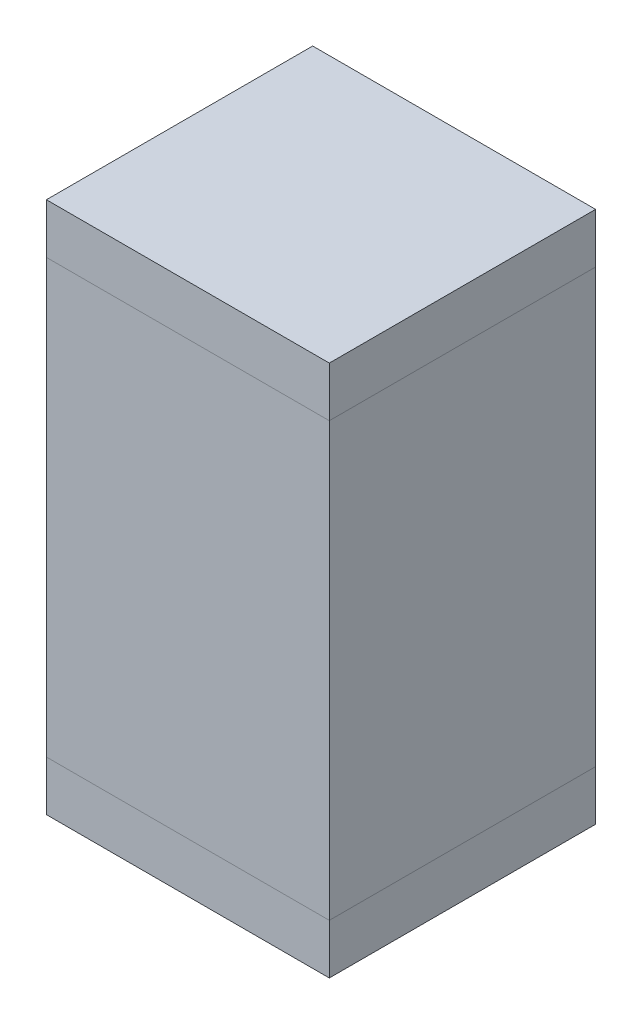
ISO-10303-21;
HEADER;
FILE_DESCRIPTION(('STEP AP214'),'2;1');
FILE_NAME('part.step','',(''),(''),'','','');
FILE_SCHEMA(('AUTOMOTIVE_DESIGN { 1 0 10303 214 1 1 1 1 }'));
ENDSEC;
DATA;
#1=APPLICATION_CONTEXT('core data for automotive mechanical design processes');
#2=APPLICATION_PROTOCOL_DEFINITION('international standard','automotive_design',2000,#1);
#3=PRODUCT_CONTEXT('',#1,'mechanical');
#4=PRODUCT('Part','Part','',(#3));
#5=PRODUCT_RELATED_PRODUCT_CATEGORY('part','',(#4));
#6=PRODUCT_DEFINITION_FORMATION('','',#4);
#7=PRODUCT_DEFINITION_CONTEXT('part definition',#1,'design');
#8=PRODUCT_DEFINITION('design','',#6,#7);
#9=PRODUCT_DEFINITION_SHAPE('','',#8);
#10=(LENGTH_UNIT() NAMED_UNIT(*) SI_UNIT(.MILLI.,.METRE.));
#11=(NAMED_UNIT(*) PLANE_ANGLE_UNIT() SI_UNIT($,.RADIAN.));
#12=(NAMED_UNIT(*) SI_UNIT($,.STERADIAN.) SOLID_ANGLE_UNIT());
#13=UNCERTAINTY_MEASURE_WITH_UNIT(LENGTH_MEASURE(1.E-05),#10,'distance_accuracy_value','');
#14=(GEOMETRIC_REPRESENTATION_CONTEXT(3) GLOBAL_UNCERTAINTY_ASSIGNED_CONTEXT((#13)) GLOBAL_UNIT_ASSIGNED_CONTEXT((#10,
#11,#12)) REPRESENTATION_CONTEXT('',''));
#15=CARTESIAN_POINT('',(0.,0.,0.));
#16=DIRECTION('',(0.,0.,1.));
#17=DIRECTION('',(1.,0.,0.));
#18=AXIS2_PLACEMENT_3D('',#15,#16,#17);
#19=CARTESIAN_POINT('',(0.,0.,0.));
#20=DIRECTION('',(0.,0.,1.));
#21=DIRECTION('',(1.,0.,0.));
#22=AXIS2_PLACEMENT_3D('',#19,#20,#21);
#23=PLANE('',#22);
#24=DIRECTION('',(1.,0.,0.));
#25=VECTOR('',#24,1.);
#26=CARTESIAN_POINT('',(-0.425,0.65,0.));
#27=LINE('',#26,#25);
#28=CARTESIAN_POINT('',(-0.425,0.65,0.));
#29=VERTEX_POINT('',#28);
#30=CARTESIAN_POINT('',(0.425,0.65,0.));
#31=VERTEX_POINT('',#30);
#32=EDGE_CURVE('P0_E20',#29,#31,#27,.T.);
#33=ORIENTED_EDGE('',*,*,#32,.T.);
#34=DIRECTION('',(0.,-1.,0.));
#35=VECTOR('',#34,1.);
#36=CARTESIAN_POINT('',(0.425,0.65,0.));
#37=LINE('',#36,#35);
#38=CARTESIAN_POINT('',(0.425,-0.65,0.));
#39=VERTEX_POINT('',#38);
#40=EDGE_CURVE('P0_E100',#31,#39,#37,.T.);
#41=ORIENTED_EDGE('',*,*,#40,.T.);
#42=DIRECTION('',(-1.,0.,0.));
#43=VECTOR('',#42,1.);
#44=CARTESIAN_POINT('',(0.425,-0.65,0.));
#45=LINE('',#44,#43);
#46=CARTESIAN_POINT('',(-0.425,-0.65,0.));
#47=VERTEX_POINT('',#46);
#48=EDGE_CURVE('P0_E86',#39,#47,#45,.T.);
#49=ORIENTED_EDGE('',*,*,#48,.T.);
#50=DIRECTION('',(0.,1.,0.));
#51=VECTOR('',#50,1.);
#52=CARTESIAN_POINT('',(-0.425,-0.65,0.));
#53=LINE('',#52,#51);
#54=EDGE_CURVE('P0_E71',#47,#29,#53,.T.);
#55=ORIENTED_EDGE('',*,*,#54,.T.);
#56=EDGE_LOOP('',(#33,#41,#49,#55));
#57=FACE_BOUND('',#56,.T.);
#58=ADVANCED_FACE('P0_F17',(#57),#23,.F.);
#59=CARTESIAN_POINT('',(0.,0.,0.8));
#60=DIRECTION('',(0.,0.,1.));
#61=DIRECTION('',(1.,0.,0.));
#62=AXIS2_PLACEMENT_3D('',#59,#60,#61);
#63=PLANE('',#62);
#64=DIRECTION('',(-1.,0.,0.));
#65=VECTOR('',#64,1.);
#66=CARTESIAN_POINT('',(-0.425,0.65,0.8));
#67=LINE('',#66,#65);
#68=CARTESIAN_POINT('',(0.425,0.65,0.8));
#69=VERTEX_POINT('',#68);
#70=CARTESIAN_POINT('',(-0.425,0.65,0.8));
#71=VERTEX_POINT('',#70);
#72=EDGE_CURVE('P0_E11',#69,#71,#67,.T.);
#73=ORIENTED_EDGE('',*,*,#72,.T.);
#74=DIRECTION('',(0.,-1.,0.));
#75=VECTOR('',#74,1.);
#76=CARTESIAN_POINT('',(-0.425,-0.65,0.8));
#77=LINE('',#76,#75);
#78=CARTESIAN_POINT('',(-0.425,-0.65,0.8));
#79=VERTEX_POINT('',#78);
#80=EDGE_CURVE('P0_E61',#71,#79,#77,.T.);
#81=ORIENTED_EDGE('',*,*,#80,.T.);
#82=DIRECTION('',(1.,0.,0.));
#83=VECTOR('',#82,1.);
#84=CARTESIAN_POINT('',(0.425,-0.65,0.8));
#85=LINE('',#84,#83);
#86=CARTESIAN_POINT('',(0.425,-0.65,0.8));
#87=VERTEX_POINT('',#86);
#88=EDGE_CURVE('P0_E65',#79,#87,#85,.T.);
#89=ORIENTED_EDGE('',*,*,#88,.T.);
#90=DIRECTION('',(0.,1.,0.));
#91=VECTOR('',#90,1.);
#92=CARTESIAN_POINT('',(0.425,0.65,0.8));
#93=LINE('',#92,#91);
#94=EDGE_CURVE('P0_E104',#87,#69,#93,.T.);
#95=ORIENTED_EDGE('',*,*,#94,.T.);
#96=EDGE_LOOP('',(#73,#81,#89,#95));
#97=FACE_BOUND('',#96,.T.);
#98=ADVANCED_FACE('P0_F63',(#97),#63,.T.);
#99=CARTESIAN_POINT('',(0.425,0.65,0.));
#100=DIRECTION('',(0.,1.,0.));
#101=DIRECTION('',(1.,0.,0.));
#102=AXIS2_PLACEMENT_3D('',#99,#100,#101);
#103=PLANE('',#102);
#104=ORIENTED_EDGE('',*,*,#32,.F.);
#105=DIRECTION('',(0.,0.,1.));
#106=VECTOR('',#105,1.);
#107=CARTESIAN_POINT('',(-0.425,0.65,0.));
#108=LINE('',#107,#106);
#109=EDGE_CURVE('P0_E70',#29,#71,#108,.T.);
#110=ORIENTED_EDGE('',*,*,#109,.T.);
#111=ORIENTED_EDGE('',*,*,#72,.F.);
#112=DIRECTION('',(0.,0.,1.));
#113=VECTOR('',#112,1.);
#114=CARTESIAN_POINT('',(0.425,0.65,0.));
#115=LINE('',#114,#113);
#116=EDGE_CURVE('P0_E109',#31,#69,#115,.T.);
#117=ORIENTED_EDGE('',*,*,#116,.F.);
#118=EDGE_LOOP('',(#104,#110,#111,#117));
#119=FACE_BOUND('',#118,.T.);
#120=ADVANCED_FACE('P0_F124',(#119),#103,.T.);
#121=CARTESIAN_POINT('',(-0.425,0.65,0.));
#122=DIRECTION('',(-1.,0.,0.));
#123=DIRECTION('',(0.,0.,1.));
#124=AXIS2_PLACEMENT_3D('',#121,#122,#123);
#125=PLANE('',#124);
#126=ORIENTED_EDGE('',*,*,#54,.F.);
#127=DIRECTION('',(0.,0.,1.));
#128=VECTOR('',#127,1.);
#129=CARTESIAN_POINT('',(-0.425,-0.65,0.));
#130=LINE('',#129,#128);
#131=EDGE_CURVE('P0_E74',#47,#79,#130,.T.);
#132=ORIENTED_EDGE('',*,*,#131,.T.);
#133=ORIENTED_EDGE('',*,*,#80,.F.);
#134=ORIENTED_EDGE('',*,*,#109,.F.);
#135=EDGE_LOOP('',(#126,#132,#133,#134));
#136=FACE_BOUND('',#135,.T.);
#137=ADVANCED_FACE('P0_F75',(#136),#125,.T.);
#138=CARTESIAN_POINT('',(-0.425,-0.65,0.));
#139=DIRECTION('',(0.,-1.,0.));
#140=DIRECTION('',(0.,0.,-1.));
#141=AXIS2_PLACEMENT_3D('',#138,#139,#140);
#142=PLANE('',#141);
#143=ORIENTED_EDGE('',*,*,#48,.F.);
#144=DIRECTION('',(0.,0.,1.));
#145=VECTOR('',#144,1.);
#146=CARTESIAN_POINT('',(0.425,-0.65,0.));
#147=LINE('',#146,#145);
#148=EDGE_CURVE('P0_E83',#39,#87,#147,.T.);
#149=ORIENTED_EDGE('',*,*,#148,.T.);
#150=ORIENTED_EDGE('',*,*,#88,.F.);
#151=ORIENTED_EDGE('',*,*,#131,.F.);
#152=EDGE_LOOP('',(#143,#149,#150,#151));
#153=FACE_BOUND('',#152,.T.);
#154=ADVANCED_FACE('P0_F81',(#153),#142,.T.);
#155=CARTESIAN_POINT('',(0.425,-0.65,0.));
#156=DIRECTION('',(1.,0.,0.));
#157=DIRECTION('',(0.,1.,0.));
#158=AXIS2_PLACEMENT_3D('',#155,#156,#157);
#159=PLANE('',#158);
#160=ORIENTED_EDGE('',*,*,#40,.F.);
#161=ORIENTED_EDGE('',*,*,#116,.T.);
#162=ORIENTED_EDGE('',*,*,#94,.F.);
#163=ORIENTED_EDGE('',*,*,#148,.F.);
#164=EDGE_LOOP('',(#160,#161,#162,#163));
#165=FACE_BOUND('',#164,.T.);
#166=ADVANCED_FACE('P0_F102',(#165),#159,.T.);
#167=CLOSED_SHELL('',(#58,#98,#120,#137,#154,#166));
#168=MANIFOLD_SOLID_BREP('P0_B1',#167);
#169=CARTESIAN_POINT('',(0.425,0.65,0.));
#170=DIRECTION('',(0.,1.,0.));
#171=DIRECTION('',(1.,0.,0.));
#172=AXIS2_PLACEMENT_3D('',#169,#170,#171);
#173=PLANE('',#172);
#174=DIRECTION('',(1.,0.,0.));
#175=VECTOR('',#174,1.);
#176=CARTESIAN_POINT('',(-0.425,0.65,0.));
#177=LINE('',#176,#175);
#178=CARTESIAN_POINT('',(-0.425,0.65,0.));
#179=VERTEX_POINT('',#178);
#180=CARTESIAN_POINT('',(0.425,0.65,0.));
#181=VERTEX_POINT('',#180);
#182=EDGE_CURVE('P1_E20',#179,#181,#177,.T.);
#183=ORIENTED_EDGE('',*,*,#182,.T.);
#184=DIRECTION('',(0.,0.,1.));
#185=VECTOR('',#184,1.);
#186=CARTESIAN_POINT('',(0.425,0.65,0.));
#187=LINE('',#186,#185);
#188=CARTESIAN_POINT('',(0.425,0.65,0.8));
#189=VERTEX_POINT('',#188);
#190=EDGE_CURVE('P1_E89',#181,#189,#187,.T.);
#191=ORIENTED_EDGE('',*,*,#190,.T.);
#192=DIRECTION('',(-1.,0.,0.));
#193=VECTOR('',#192,1.);
#194=CARTESIAN_POINT('',(-0.425,0.65,0.8));
#195=LINE('',#194,#193);
#196=CARTESIAN_POINT('',(-0.425,0.65,0.8));
#197=VERTEX_POINT('',#196);
#198=EDGE_CURVE('P1_E82',#189,#197,#195,.T.);
#199=ORIENTED_EDGE('',*,*,#198,.T.);
#200=DIRECTION('',(0.,0.,1.));
#201=VECTOR('',#200,1.);
#202=CARTESIAN_POINT('',(-0.425,0.65,0.));
#203=LINE('',#202,#201);
#204=EDGE_CURVE('P1_E66',#179,#197,#203,.T.);
#205=ORIENTED_EDGE('',*,*,#204,.F.);
#206=EDGE_LOOP('',(#183,#191,#199,#205));
#207=FACE_BOUND('',#206,.T.);
#208=ADVANCED_FACE('P1_F17',(#207),#173,.F.);
#209=CARTESIAN_POINT('',(0.425,0.8,0.));
#210=DIRECTION('',(0.,1.,0.));
#211=DIRECTION('',(1.,0.,0.));
#212=AXIS2_PLACEMENT_3D('',#209,#210,#211);
#213=PLANE('',#212);
#214=DIRECTION('',(-1.,0.,0.));
#215=VECTOR('',#214,1.);
#216=CARTESIAN_POINT('',(-0.425,0.8,0.));
#217=LINE('',#216,#215);
#218=CARTESIAN_POINT('',(0.425,0.8,0.));
#219=VERTEX_POINT('',#218);
#220=CARTESIAN_POINT('',(-0.425,0.8,0.));
#221=VERTEX_POINT('',#220);
#222=EDGE_CURVE('P1_E11',#219,#221,#217,.T.);
#223=ORIENTED_EDGE('',*,*,#222,.T.);
#224=DIRECTION('',(0.,0.,1.));
#225=VECTOR('',#224,1.);
#226=CARTESIAN_POINT('',(-0.425,0.8,0.));
#227=LINE('',#226,#225);
#228=CARTESIAN_POINT('',(-0.425,0.8,0.8));
#229=VERTEX_POINT('',#228);
#230=EDGE_CURVE('P1_E76',#221,#229,#227,.T.);
#231=ORIENTED_EDGE('',*,*,#230,.T.);
#232=DIRECTION('',(1.,0.,0.));
#233=VECTOR('',#232,1.);
#234=CARTESIAN_POINT('',(-0.425,0.8,0.8));
#235=LINE('',#234,#233);
#236=CARTESIAN_POINT('',(0.425,0.8,0.8));
#237=VERTEX_POINT('',#236);
#238=EDGE_CURVE('P1_E84',#229,#237,#235,.T.);
#239=ORIENTED_EDGE('',*,*,#238,.T.);
#240=DIRECTION('',(0.,0.,-1.));
#241=VECTOR('',#240,1.);
#242=CARTESIAN_POINT('',(0.425,0.8,0.));
#243=LINE('',#242,#241);
#244=EDGE_CURVE('P1_E98',#237,#219,#243,.T.);
#245=ORIENTED_EDGE('',*,*,#244,.T.);
#246=EDGE_LOOP('',(#223,#231,#239,#245));
#247=FACE_BOUND('',#246,.T.);
#248=ADVANCED_FACE('P1_F121',(#247),#213,.T.);
#249=CARTESIAN_POINT('',(0.425,0.65,0.));
#250=DIRECTION('',(0.,0.,-1.));
#251=DIRECTION('',(0.,-1.,0.));
#252=AXIS2_PLACEMENT_3D('',#249,#250,#251);
#253=PLANE('',#252);
#254=ORIENTED_EDGE('',*,*,#182,.F.);
#255=DIRECTION('',(0.,1.,0.));
#256=VECTOR('',#255,1.);
#257=CARTESIAN_POINT('',(-0.425,0.65,0.));
#258=LINE('',#257,#256);
#259=EDGE_CURVE('P1_E72',#179,#221,#258,.T.);
#260=ORIENTED_EDGE('',*,*,#259,.T.);
#261=ORIENTED_EDGE('',*,*,#222,.F.);
#262=DIRECTION('',(0.,1.,0.));
#263=VECTOR('',#262,1.);
#264=CARTESIAN_POINT('',(0.425,0.65,0.));
#265=LINE('',#264,#263);
#266=EDGE_CURVE('P1_E109',#181,#219,#265,.T.);
#267=ORIENTED_EDGE('',*,*,#266,.F.);
#268=EDGE_LOOP('',(#254,#260,#261,#267));
#269=FACE_BOUND('',#268,.T.);
#270=ADVANCED_FACE('P1_F128',(#269),#253,.T.);
#271=CARTESIAN_POINT('',(-0.425,0.65,0.));
#272=DIRECTION('',(-1.,0.,0.));
#273=DIRECTION('',(0.,0.,1.));
#274=AXIS2_PLACEMENT_3D('',#271,#272,#273);
#275=PLANE('',#274);
#276=ORIENTED_EDGE('',*,*,#204,.T.);
#277=DIRECTION('',(0.,1.,0.));
#278=VECTOR('',#277,1.);
#279=CARTESIAN_POINT('',(-0.425,0.65,0.8));
#280=LINE('',#279,#278);
#281=EDGE_CURVE('P1_E70',#197,#229,#280,.T.);
#282=ORIENTED_EDGE('',*,*,#281,.T.);
#283=ORIENTED_EDGE('',*,*,#230,.F.);
#284=ORIENTED_EDGE('',*,*,#259,.F.);
#285=EDGE_LOOP('',(#276,#282,#283,#284));
#286=FACE_BOUND('',#285,.T.);
#287=ADVANCED_FACE('P1_F68',(#286),#275,.T.);
#288=CARTESIAN_POINT('',(-0.425,0.65,0.8));
#289=DIRECTION('',(0.,0.,1.));
#290=DIRECTION('',(1.,0.,0.));
#291=AXIS2_PLACEMENT_3D('',#288,#289,#290);
#292=PLANE('',#291);
#293=ORIENTED_EDGE('',*,*,#198,.F.);
#294=DIRECTION('',(0.,1.,0.));
#295=VECTOR('',#294,1.);
#296=CARTESIAN_POINT('',(0.425,0.65,0.8));
#297=LINE('',#296,#295);
#298=EDGE_CURVE('P1_E91',#189,#237,#297,.T.);
#299=ORIENTED_EDGE('',*,*,#298,.T.);
#300=ORIENTED_EDGE('',*,*,#238,.F.);
#301=ORIENTED_EDGE('',*,*,#281,.F.);
#302=EDGE_LOOP('',(#293,#299,#300,#301));
#303=FACE_BOUND('',#302,.T.);
#304=ADVANCED_FACE('P1_F80',(#303),#292,.T.);
#305=CARTESIAN_POINT('',(0.425,0.65,0.8));
#306=DIRECTION('',(1.,0.,0.));
#307=DIRECTION('',(0.,1.,0.));
#308=AXIS2_PLACEMENT_3D('',#305,#306,#307);
#309=PLANE('',#308);
#310=ORIENTED_EDGE('',*,*,#190,.F.);
#311=ORIENTED_EDGE('',*,*,#266,.T.);
#312=ORIENTED_EDGE('',*,*,#244,.F.);
#313=ORIENTED_EDGE('',*,*,#298,.F.);
#314=EDGE_LOOP('',(#310,#311,#312,#313));
#315=FACE_BOUND('',#314,.T.);
#316=ADVANCED_FACE('P1_F122',(#315),#309,.T.);
#317=CLOSED_SHELL('',(#208,#248,#270,#287,#304,#316));
#318=MANIFOLD_SOLID_BREP('P1_B1',#317);
#319=CARTESIAN_POINT('',(-0.425,-0.65,0.));
#320=DIRECTION('',(0.,-1.,0.));
#321=DIRECTION('',(0.,0.,-1.));
#322=AXIS2_PLACEMENT_3D('',#319,#320,#321);
#323=PLANE('',#322);
#324=DIRECTION('',(-1.,0.,0.));
#325=VECTOR('',#324,1.);
#326=CARTESIAN_POINT('',(0.425,-0.65,0.));
#327=LINE('',#326,#325);
#328=CARTESIAN_POINT('',(0.425,-0.65,0.));
#329=VERTEX_POINT('',#328);
#330=CARTESIAN_POINT('',(-0.425,-0.65,0.));
#331=VERTEX_POINT('',#330);
#332=EDGE_CURVE('P2_E25',#329,#331,#327,.T.);
#333=ORIENTED_EDGE('',*,*,#332,.T.);
#334=DIRECTION('',(0.,0.,1.));
#335=VECTOR('',#334,1.);
#336=CARTESIAN_POINT('',(-0.425,-0.65,0.));
#337=LINE('',#336,#335);
#338=CARTESIAN_POINT('',(-0.425,-0.65,0.8));
#339=VERTEX_POINT('',#338);
#340=EDGE_CURVE('P2_E71',#331,#339,#337,.T.);
#341=ORIENTED_EDGE('',*,*,#340,.T.);
#342=DIRECTION('',(1.,0.,0.));
#343=VECTOR('',#342,1.);
#344=CARTESIAN_POINT('',(0.425,-0.65,0.8));
#345=LINE('',#344,#343);
#346=CARTESIAN_POINT('',(0.425,-0.65,0.8));
#347=VERTEX_POINT('',#346);
#348=EDGE_CURVE('P2_E99',#339,#347,#345,.T.);
#349=ORIENTED_EDGE('',*,*,#348,.T.);
#350=DIRECTION('',(0.,0.,1.));
#351=VECTOR('',#350,1.);
#352=CARTESIAN_POINT('',(0.425,-0.65,0.));
#353=LINE('',#352,#351);
#354=EDGE_CURVE('P2_E72',#329,#347,#353,.T.);
#355=ORIENTED_EDGE('',*,*,#354,.F.);
#356=EDGE_LOOP('',(#333,#341,#349,#355));
#357=FACE_BOUND('',#356,.T.);
#358=ADVANCED_FACE('P2_F17',(#357),#323,.F.);
#359=CARTESIAN_POINT('',(-0.425,-0.8,0.));
#360=DIRECTION('',(0.,-1.,0.));
#361=DIRECTION('',(0.,0.,-1.));
#362=AXIS2_PLACEMENT_3D('',#359,#360,#361);
#363=PLANE('',#362);
#364=DIRECTION('',(1.,0.,0.));
#365=VECTOR('',#364,1.);
#366=CARTESIAN_POINT('',(0.425,-0.8,0.));
#367=LINE('',#366,#365);
#368=CARTESIAN_POINT('',(-0.425,-0.8,0.));
#369=VERTEX_POINT('',#368);
#370=CARTESIAN_POINT('',(0.425,-0.8,0.));
#371=VERTEX_POINT('',#370);
#372=EDGE_CURVE('P2_E11',#369,#371,#367,.T.);
#373=ORIENTED_EDGE('',*,*,#372,.T.);
#374=DIRECTION('',(0.,0.,1.));
#375=VECTOR('',#374,1.);
#376=CARTESIAN_POINT('',(0.425,-0.8,0.));
#377=LINE('',#376,#375);
#378=CARTESIAN_POINT('',(0.425,-0.8,0.8));
#379=VERTEX_POINT('',#378);
#380=EDGE_CURVE('P2_E93',#371,#379,#377,.T.);
#381=ORIENTED_EDGE('',*,*,#380,.T.);
#382=DIRECTION('',(-1.,0.,0.));
#383=VECTOR('',#382,1.);
#384=CARTESIAN_POINT('',(0.425,-0.8,0.8));
#385=LINE('',#384,#383);
#386=CARTESIAN_POINT('',(-0.425,-0.8,0.8));
#387=VERTEX_POINT('',#386);
#388=EDGE_CURVE('P2_E102',#379,#387,#385,.T.);
#389=ORIENTED_EDGE('',*,*,#388,.T.);
#390=DIRECTION('',(0.,0.,-1.));
#391=VECTOR('',#390,1.);
#392=CARTESIAN_POINT('',(-0.425,-0.8,0.));
#393=LINE('',#392,#391);
#394=EDGE_CURVE('P2_E81',#387,#369,#393,.T.);
#395=ORIENTED_EDGE('',*,*,#394,.T.);
#396=EDGE_LOOP('',(#373,#381,#389,#395));
#397=FACE_BOUND('',#396,.T.);
#398=ADVANCED_FACE('P2_F120',(#397),#363,.T.);
#399=CARTESIAN_POINT('',(-0.425,-0.65,0.));
#400=DIRECTION('',(0.,0.,-1.));
#401=DIRECTION('',(0.,-1.,0.));
#402=AXIS2_PLACEMENT_3D('',#399,#400,#401);
#403=PLANE('',#402);
#404=ORIENTED_EDGE('',*,*,#332,.F.);
#405=DIRECTION('',(0.,-1.,0.));
#406=VECTOR('',#405,1.);
#407=CARTESIAN_POINT('',(0.425,-0.65,0.));
#408=LINE('',#407,#406);
#409=EDGE_CURVE('P2_E74',#329,#371,#408,.T.);
#410=ORIENTED_EDGE('',*,*,#409,.T.);
#411=ORIENTED_EDGE('',*,*,#372,.F.);
#412=DIRECTION('',(0.,-1.,0.));
#413=VECTOR('',#412,1.);
#414=CARTESIAN_POINT('',(-0.425,-0.65,0.));
#415=LINE('',#414,#413);
#416=EDGE_CURVE('P2_E76',#331,#369,#415,.T.);
#417=ORIENTED_EDGE('',*,*,#416,.F.);
#418=EDGE_LOOP('',(#404,#410,#411,#417));
#419=FACE_BOUND('',#418,.T.);
#420=ADVANCED_FACE('P2_F77',(#419),#403,.T.);
#421=CARTESIAN_POINT('',(0.425,-0.65,0.));
#422=DIRECTION('',(1.,0.,0.));
#423=DIRECTION('',(0.,1.,0.));
#424=AXIS2_PLACEMENT_3D('',#421,#422,#423);
#425=PLANE('',#424);
#426=ORIENTED_EDGE('',*,*,#354,.T.);
#427=DIRECTION('',(0.,-1.,0.));
#428=VECTOR('',#427,1.);
#429=CARTESIAN_POINT('',(0.425,-0.65,0.8));
#430=LINE('',#429,#428);
#431=EDGE_CURVE('P2_E105',#347,#379,#430,.T.);
#432=ORIENTED_EDGE('',*,*,#431,.T.);
#433=ORIENTED_EDGE('',*,*,#380,.F.);
#434=ORIENTED_EDGE('',*,*,#409,.F.);
#435=EDGE_LOOP('',(#426,#432,#433,#434));
#436=FACE_BOUND('',#435,.T.);
#437=ADVANCED_FACE('P2_F117',(#436),#425,.T.);
#438=CARTESIAN_POINT('',(0.425,-0.65,0.8));
#439=DIRECTION('',(0.,0.,1.));
#440=DIRECTION('',(1.,0.,0.));
#441=AXIS2_PLACEMENT_3D('',#438,#439,#440);
#442=PLANE('',#441);
#443=ORIENTED_EDGE('',*,*,#348,.F.);
#444=DIRECTION('',(0.,-1.,0.));
#445=VECTOR('',#444,1.);
#446=CARTESIAN_POINT('',(-0.425,-0.65,0.8));
#447=LINE('',#446,#445);
#448=EDGE_CURVE('P2_E86',#339,#387,#447,.T.);
#449=ORIENTED_EDGE('',*,*,#448,.T.);
#450=ORIENTED_EDGE('',*,*,#388,.F.);
#451=ORIENTED_EDGE('',*,*,#431,.F.);
#452=EDGE_LOOP('',(#443,#449,#450,#451));
#453=FACE_BOUND('',#452,.T.);
#454=ADVANCED_FACE('P2_F119',(#453),#442,.T.);
#455=CARTESIAN_POINT('',(-0.425,-0.65,0.8));
#456=DIRECTION('',(-1.,0.,0.));
#457=DIRECTION('',(0.,0.,1.));
#458=AXIS2_PLACEMENT_3D('',#455,#456,#457);
#459=PLANE('',#458);
#460=ORIENTED_EDGE('',*,*,#340,.F.);
#461=ORIENTED_EDGE('',*,*,#416,.T.);
#462=ORIENTED_EDGE('',*,*,#394,.F.);
#463=ORIENTED_EDGE('',*,*,#448,.F.);
#464=EDGE_LOOP('',(#460,#461,#462,#463));
#465=FACE_BOUND('',#464,.T.);
#466=ADVANCED_FACE('P2_F84',(#465),#459,.T.);
#467=CLOSED_SHELL('',(#358,#398,#420,#437,#454,#466));
#468=MANIFOLD_SOLID_BREP('P2_B1',#467);
#469=ADVANCED_BREP_SHAPE_REPRESENTATION('',(#18,#168,#318,#468),#14);
#470=SHAPE_DEFINITION_REPRESENTATION(#9,#469);
ENDSEC;
END-ISO-10303-21;
